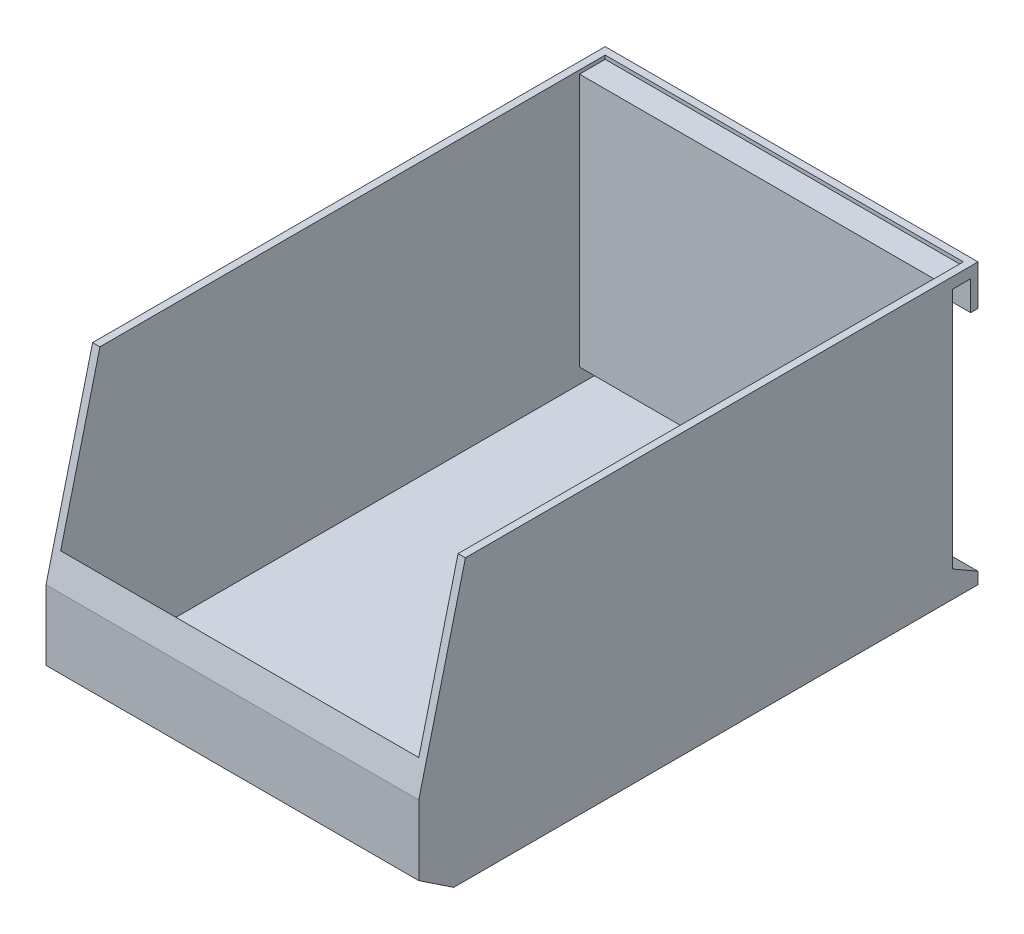
ISO-10303-21;
HEADER;
FILE_DESCRIPTION(('STEP AP214'),'2;1');
FILE_NAME('part.step','',(''),(''),'','','');
FILE_SCHEMA(('AUTOMOTIVE_DESIGN { 1 0 10303 214 1 1 1 1 }'));
ENDSEC;
DATA;
#1=APPLICATION_CONTEXT('core data for automotive mechanical design processes');
#2=APPLICATION_PROTOCOL_DEFINITION('international standard','automotive_design',2000,#1);
#3=PRODUCT_CONTEXT('',#1,'mechanical');
#4=PRODUCT('Part','Part','',(#3));
#5=PRODUCT_RELATED_PRODUCT_CATEGORY('part','',(#4));
#6=PRODUCT_DEFINITION_FORMATION('','',#4);
#7=PRODUCT_DEFINITION_CONTEXT('part definition',#1,'design');
#8=PRODUCT_DEFINITION('design','',#6,#7);
#9=PRODUCT_DEFINITION_SHAPE('','',#8);
#10=(LENGTH_UNIT() NAMED_UNIT(*) SI_UNIT(.MILLI.,.METRE.));
#11=(NAMED_UNIT(*) PLANE_ANGLE_UNIT() SI_UNIT($,.RADIAN.));
#12=(NAMED_UNIT(*) SI_UNIT($,.STERADIAN.) SOLID_ANGLE_UNIT());
#13=UNCERTAINTY_MEASURE_WITH_UNIT(LENGTH_MEASURE(1.E-05),#10,'distance_accuracy_value','');
#14=(GEOMETRIC_REPRESENTATION_CONTEXT(3) GLOBAL_UNCERTAINTY_ASSIGNED_CONTEXT((#13)) GLOBAL_UNIT_ASSIGNED_CONTEXT((#10,
#11,#12)) REPRESENTATION_CONTEXT('',''));
#15=CARTESIAN_POINT('',(0.,0.,0.));
#16=DIRECTION('',(0.,0.,1.));
#17=DIRECTION('',(1.,0.,0.));
#18=AXIS2_PLACEMENT_3D('',#15,#16,#17);
#19=CARTESIAN_POINT('',(0.,76.2,0.));
#20=DIRECTION('',(0.,-1.,0.));
#21=DIRECTION('',(0.,0.,-1.));
#22=AXIS2_PLACEMENT_3D('',#19,#20,#21);
#23=PLANE('',#22);
#24=DIRECTION('',(0.,0.,1.));
#25=VECTOR('',#24,1.);
#26=CARTESIAN_POINT('',(-48.8,76.2,0.));
#27=LINE('',#26,#25);
#28=CARTESIAN_POINT('',(-48.8,76.2,-74.2));
#29=VERTEX_POINT('',#28);
#30=CARTESIAN_POINT('',(-48.8,76.2,63.5));
#31=VERTEX_POINT('',#30);
#32=EDGE_CURVE('E206',#29,#31,#27,.T.);
#33=ORIENTED_EDGE('',*,*,#32,.F.);
#34=DIRECTION('',(-1.,0.,0.));
#35=VECTOR('',#34,1.);
#36=CARTESIAN_POINT('',(0.,76.2,-74.2));
#37=LINE('',#36,#35);
#38=CARTESIAN_POINT('',(48.8,76.2,-74.2));
#39=VERTEX_POINT('',#38);
#40=EDGE_CURVE('E210',#39,#29,#37,.T.);
#41=ORIENTED_EDGE('',*,*,#40,.F.);
#42=DIRECTION('',(0.,0.,-1.));
#43=VECTOR('',#42,1.);
#44=CARTESIAN_POINT('',(48.8,76.2,0.));
#45=LINE('',#44,#43);
#46=CARTESIAN_POINT('',(48.8,76.2,63.5));
#47=VERTEX_POINT('',#46);
#48=EDGE_CURVE('E246',#47,#39,#45,.T.);
#49=ORIENTED_EDGE('',*,*,#48,.F.);
#50=DIRECTION('',(1.,0.,0.));
#51=VECTOR('',#50,1.);
#52=CARTESIAN_POINT('',(-50.8,76.2,63.5));
#53=LINE('',#52,#51);
#54=CARTESIAN_POINT('',(50.8,76.2,63.5));
#55=VERTEX_POINT('',#54);
#56=EDGE_CURVE('E315',#47,#55,#53,.T.);
#57=ORIENTED_EDGE('',*,*,#56,.T.);
#58=DIRECTION('',(0.,0.,-1.));
#59=VECTOR('',#58,1.);
#60=CARTESIAN_POINT('',(50.8,76.2,76.2));
#61=LINE('',#60,#59);
#62=CARTESIAN_POINT('',(50.8,76.2,-76.2));
#63=VERTEX_POINT('',#62);
#64=EDGE_CURVE('E325',#55,#63,#61,.T.);
#65=ORIENTED_EDGE('',*,*,#64,.T.);
#66=DIRECTION('',(-1.,0.,0.));
#67=VECTOR('',#66,1.);
#68=CARTESIAN_POINT('',(-50.8,76.2,-76.2));
#69=LINE('',#68,#67);
#70=CARTESIAN_POINT('',(-50.8,76.2,-76.2));
#71=VERTEX_POINT('',#70);
#72=EDGE_CURVE('E327',#63,#71,#69,.T.);
#73=ORIENTED_EDGE('',*,*,#72,.T.);
#74=DIRECTION('',(0.,0.,1.));
#75=VECTOR('',#74,1.);
#76=CARTESIAN_POINT('',(-50.8,76.2,76.2));
#77=LINE('',#76,#75);
#78=CARTESIAN_POINT('',(-50.8,76.2,63.5));
#79=VERTEX_POINT('',#78);
#80=EDGE_CURVE('E330',#71,#79,#77,.T.);
#81=ORIENTED_EDGE('',*,*,#80,.T.);
#82=EDGE_CURVE('E311',#79,#31,#53,.T.);
#83=ORIENTED_EDGE('',*,*,#82,.T.);
#84=EDGE_LOOP('',(#33,#41,#49,#57,#65,#73,#81,#83));
#85=FACE_BOUND('',#84,.T.);
#86=ADVANCED_FACE('F34',(#85),#23,.F.);
#87=CARTESIAN_POINT('',(-50.8,76.2,63.5));
#88=DIRECTION('',(0.,-0.242535625036333,-0.970142500145332));
#89=DIRECTION('',(0.,0.970142500145332,-0.242535625036333));
#90=AXIS2_PLACEMENT_3D('',#87,#88,#89);
#91=PLANE('',#90);
#92=DIRECTION('',(0.,0.970142500145332,-0.242535625036333));
#93=VECTOR('',#92,1.);
#94=CARTESIAN_POINT('',(48.8,76.2,63.5));
#95=LINE('',#94,#93);
#96=CARTESIAN_POINT('',(48.8,33.4,74.2));
#97=VERTEX_POINT('',#96);
#98=EDGE_CURVE('E249',#97,#47,#95,.T.);
#99=ORIENTED_EDGE('',*,*,#98,.F.);
#100=DIRECTION('',(1.,0.,0.));
#101=VECTOR('',#100,1.);
#102=CARTESIAN_POINT('',(-50.8,33.4,74.2));
#103=LINE('',#102,#101);
#104=CARTESIAN_POINT('',(-48.8,33.4,74.2));
#105=VERTEX_POINT('',#104);
#106=EDGE_CURVE('E205',#105,#97,#103,.T.);
#107=ORIENTED_EDGE('',*,*,#106,.F.);
#108=DIRECTION('',(0.,0.970142500145332,-0.242535625036333));
#109=VECTOR('',#108,1.);
#110=CARTESIAN_POINT('',(-48.8,73.2117647058823,64.2470588235294));
#111=LINE('',#110,#109);
#112=EDGE_CURVE('E253',#105,#31,#111,.T.);
#113=ORIENTED_EDGE('',*,*,#112,.T.);
#114=ORIENTED_EDGE('',*,*,#82,.F.);
#115=DIRECTION('',(0.,0.970142500145332,-0.242535625036333));
#116=VECTOR('',#115,1.);
#117=CARTESIAN_POINT('',(-50.8,76.2,63.5));
#118=LINE('',#117,#116);
#119=CARTESIAN_POINT('',(-50.8,25.4,76.2));
#120=VERTEX_POINT('',#119);
#121=EDGE_CURVE('E303',#120,#79,#118,.T.);
#122=ORIENTED_EDGE('',*,*,#121,.F.);
#123=DIRECTION('',(1.,0.,0.));
#124=VECTOR('',#123,1.);
#125=CARTESIAN_POINT('',(-50.8,25.4,76.2));
#126=LINE('',#125,#124);
#127=CARTESIAN_POINT('',(50.8,25.4,76.2));
#128=VERTEX_POINT('',#127);
#129=EDGE_CURVE('E306',#120,#128,#126,.T.);
#130=ORIENTED_EDGE('',*,*,#129,.T.);
#131=DIRECTION('',(0.,0.970142500145332,-0.242535625036333));
#132=VECTOR('',#131,1.);
#133=CARTESIAN_POINT('',(50.8,76.2,63.5));
#134=LINE('',#133,#132);
#135=EDGE_CURVE('E307',#128,#55,#134,.T.);
#136=ORIENTED_EDGE('',*,*,#135,.T.);
#137=ORIENTED_EDGE('',*,*,#56,.F.);
#138=EDGE_LOOP('',(#99,#107,#113,#114,#122,#130,#136,#137));
#139=FACE_BOUND('',#138,.T.);
#140=ADVANCED_FACE('F408',(#139),#91,.F.);
#141=CARTESIAN_POINT('',(-50.8,76.2,-76.2));
#142=DIRECTION('',(0.,0.,1.));
#143=DIRECTION('',(1.,0.,0.));
#144=AXIS2_PLACEMENT_3D('',#141,#142,#143);
#145=PLANE('',#144);
#146=DIRECTION('',(0.,-1.,0.));
#147=VECTOR('',#146,1.);
#148=CARTESIAN_POINT('',(50.8,76.2,-76.2));
#149=LINE('',#148,#147);
#150=CARTESIAN_POINT('',(50.8,65.2,-76.2));
#151=VERTEX_POINT('',#150);
#152=EDGE_CURVE('E11',#63,#151,#149,.T.);
#153=ORIENTED_EDGE('',*,*,#152,.T.);
#154=DIRECTION('',(1.,0.,0.));
#155=VECTOR('',#154,1.);
#156=CARTESIAN_POINT('',(-50.8,65.2,-76.2));
#157=LINE('',#156,#155);
#158=CARTESIAN_POINT('',(-50.8,65.2,-76.2));
#159=VERTEX_POINT('',#158);
#160=EDGE_CURVE('E297',#159,#151,#157,.T.);
#161=ORIENTED_EDGE('',*,*,#160,.F.);
#162=DIRECTION('',(0.,-1.,0.));
#163=VECTOR('',#162,1.);
#164=CARTESIAN_POINT('',(-50.8,76.2,-76.2));
#165=LINE('',#164,#163);
#166=EDGE_CURVE('E346',#71,#159,#165,.T.);
#167=ORIENTED_EDGE('',*,*,#166,.F.);
#168=ORIENTED_EDGE('',*,*,#72,.F.);
#169=EDGE_LOOP('',(#153,#161,#167,#168));
#170=FACE_BOUND('',#169,.T.);
#171=ADVANCED_FACE('F381',(#170),#145,.F.);
#172=CARTESIAN_POINT('',(50.8,76.2,76.2));
#173=DIRECTION('',(-1.,0.,0.));
#174=DIRECTION('',(0.,0.,1.));
#175=AXIS2_PLACEMENT_3D('',#172,#173,#174);
#176=PLANE('',#175);
#177=DIRECTION('',(0.,1.,0.));
#178=VECTOR('',#177,1.);
#179=CARTESIAN_POINT('',(50.8,73.2,-74.2));
#180=LINE('',#179,#178);
#181=CARTESIAN_POINT('',(50.8,65.2,-74.2));
#182=VERTEX_POINT('',#181);
#183=CARTESIAN_POINT('',(50.8,73.2,-74.2));
#184=VERTEX_POINT('',#183);
#185=EDGE_CURVE('E285',#182,#184,#180,.T.);
#186=ORIENTED_EDGE('',*,*,#185,.F.);
#187=DIRECTION('',(0.,0.,1.));
#188=VECTOR('',#187,1.);
#189=CARTESIAN_POINT('',(50.8,65.2,-74.2));
#190=LINE('',#189,#188);
#191=EDGE_CURVE('E282',#151,#182,#190,.T.);
#192=ORIENTED_EDGE('',*,*,#191,.F.);
#193=ORIENTED_EDGE('',*,*,#152,.F.);
#194=ORIENTED_EDGE('',*,*,#64,.F.);
#195=ORIENTED_EDGE('',*,*,#135,.F.);
#196=DIRECTION('',(0.,-1.,0.));
#197=VECTOR('',#196,1.);
#198=CARTESIAN_POINT('',(50.8,76.2,76.2));
#199=LINE('',#198,#197);
#200=CARTESIAN_POINT('',(50.8,6.35,76.2));
#201=VERTEX_POINT('',#200);
#202=EDGE_CURVE('E333',#128,#201,#199,.T.);
#203=ORIENTED_EDGE('',*,*,#202,.T.);
#204=DIRECTION('',(0.,0.554700196225229,0.832050294337844));
#205=VECTOR('',#204,1.);
#206=CARTESIAN_POINT('',(50.8,6.35,76.2));
#207=LINE('',#206,#205);
#208=CARTESIAN_POINT('',(50.8,0.,66.675));
#209=VERTEX_POINT('',#208);
#210=EDGE_CURVE('E292',#209,#201,#207,.T.);
#211=ORIENTED_EDGE('',*,*,#210,.F.);
#212=DIRECTION('',(0.,0.,-1.));
#213=VECTOR('',#212,1.);
#214=CARTESIAN_POINT('',(50.8,0.,76.2));
#215=LINE('',#214,#213);
#216=CARTESIAN_POINT('',(50.8,0.,-76.2));
#217=VERTEX_POINT('',#216);
#218=EDGE_CURVE('E314',#209,#217,#215,.T.);
#219=ORIENTED_EDGE('',*,*,#218,.T.);
#220=CARTESIAN_POINT('',(50.8,3.175,-76.2));
#221=VERTEX_POINT('',#220);
#222=EDGE_CURVE('E42',#221,#217,#149,.T.);
#223=ORIENTED_EDGE('',*,*,#222,.F.);
#224=DIRECTION('',(0.,-0.499999999999995,-0.866025403784442));
#225=VECTOR('',#224,1.);
#226=CARTESIAN_POINT('',(50.8,7.21645188432733,-69.2));
#227=LINE('',#226,#225);
#228=CARTESIAN_POINT('',(50.8,7.21645188432733,-69.2));
#229=VERTEX_POINT('',#228);
#230=EDGE_CURVE('E280',#229,#221,#227,.T.);
#231=ORIENTED_EDGE('',*,*,#230,.F.);
#232=DIRECTION('',(0.,-1.,0.));
#233=VECTOR('',#232,1.);
#234=CARTESIAN_POINT('',(50.8,7.21645188432733,-69.2));
#235=LINE('',#234,#233);
#236=CARTESIAN_POINT('',(50.8,73.2,-69.2));
#237=VERTEX_POINT('',#236);
#238=EDGE_CURVE('E262',#237,#229,#235,.T.);
#239=ORIENTED_EDGE('',*,*,#238,.F.);
#240=DIRECTION('',(0.,0.,1.));
#241=VECTOR('',#240,1.);
#242=CARTESIAN_POINT('',(50.8,73.2,-69.2));
#243=LINE('',#242,#241);
#244=EDGE_CURVE('E266',#184,#237,#243,.T.);
#245=ORIENTED_EDGE('',*,*,#244,.F.);
#246=EDGE_LOOP('',(#186,#192,#193,#194,#195,#203,#211,#219,#223,#231,#239,#245));
#247=FACE_BOUND('',#246,.T.);
#248=ADVANCED_FACE('F36',(#247),#176,.F.);
#249=CARTESIAN_POINT('',(-50.8,3.175,-76.2));
#250=VERTEX_POINT('',#249);
#251=CARTESIAN_POINT('',(-50.8,0.,-76.2));
#252=VERTEX_POINT('',#251);
#253=EDGE_CURVE('E345',#250,#252,#165,.T.);
#254=ORIENTED_EDGE('',*,*,#253,.F.);
#255=DIRECTION('',(1.,0.,0.));
#256=VECTOR('',#255,1.);
#257=CARTESIAN_POINT('',(-50.8,3.175,-76.2));
#258=LINE('',#257,#256);
#259=EDGE_CURVE('E299',#250,#221,#258,.T.);
#260=ORIENTED_EDGE('',*,*,#259,.T.);
#261=ORIENTED_EDGE('',*,*,#222,.T.);
#262=DIRECTION('',(-1.,0.,0.));
#263=VECTOR('',#262,1.);
#264=CARTESIAN_POINT('',(-50.8,0.,-76.2));
#265=LINE('',#264,#263);
#266=EDGE_CURVE('E336',#217,#252,#265,.T.);
#267=ORIENTED_EDGE('',*,*,#266,.T.);
#268=EDGE_LOOP('',(#254,#260,#261,#267));
#269=FACE_BOUND('',#268,.T.);
#270=ADVANCED_FACE('F356',(#269),#145,.F.);
#271=CARTESIAN_POINT('',(-50.8,76.2,76.2));
#272=DIRECTION('',(1.,0.,0.));
#273=DIRECTION('',(0.,0.,-1.));
#274=AXIS2_PLACEMENT_3D('',#271,#272,#273);
#275=PLANE('',#274);
#276=ORIENTED_EDGE('',*,*,#166,.T.);
#277=DIRECTION('',(0.,0.,1.));
#278=VECTOR('',#277,1.);
#279=CARTESIAN_POINT('',(-50.8,65.2,-74.2));
#280=LINE('',#279,#278);
#281=CARTESIAN_POINT('',(-50.8,65.2,-74.2));
#282=VERTEX_POINT('',#281);
#283=EDGE_CURVE('E268',#159,#282,#280,.T.);
#284=ORIENTED_EDGE('',*,*,#283,.T.);
#285=DIRECTION('',(0.,1.,0.));
#286=VECTOR('',#285,1.);
#287=CARTESIAN_POINT('',(-50.8,73.2,-74.2));
#288=LINE('',#287,#286);
#289=CARTESIAN_POINT('',(-50.8,73.2,-74.2));
#290=VERTEX_POINT('',#289);
#291=EDGE_CURVE('E271',#282,#290,#288,.T.);
#292=ORIENTED_EDGE('',*,*,#291,.T.);
#293=DIRECTION('',(0.,0.,1.));
#294=VECTOR('',#293,1.);
#295=CARTESIAN_POINT('',(-50.8,73.2,-69.2));
#296=LINE('',#295,#294);
#297=CARTESIAN_POINT('',(-50.8,73.2,-69.2));
#298=VERTEX_POINT('',#297);
#299=EDGE_CURVE('E274',#290,#298,#296,.T.);
#300=ORIENTED_EDGE('',*,*,#299,.T.);
#301=DIRECTION('',(0.,-1.,0.));
#302=VECTOR('',#301,1.);
#303=CARTESIAN_POINT('',(-50.8,65.2,-69.2));
#304=LINE('',#303,#302);
#305=CARTESIAN_POINT('',(-50.8,7.21645188432733,-69.2));
#306=VERTEX_POINT('',#305);
#307=EDGE_CURVE('E263',#298,#306,#304,.T.);
#308=ORIENTED_EDGE('',*,*,#307,.T.);
#309=DIRECTION('',(0.,-0.499999999999995,-0.866025403784442));
#310=VECTOR('',#309,1.);
#311=CARTESIAN_POINT('',(-50.8,7.21645188432733,-69.2));
#312=LINE('',#311,#310);
#313=EDGE_CURVE('E57',#306,#250,#312,.T.);
#314=ORIENTED_EDGE('',*,*,#313,.T.);
#315=ORIENTED_EDGE('',*,*,#253,.T.);
#316=DIRECTION('',(0.,0.,1.));
#317=VECTOR('',#316,1.);
#318=CARTESIAN_POINT('',(-50.8,0.,76.2));
#319=LINE('',#318,#317);
#320=CARTESIAN_POINT('',(-50.8,0.,66.675));
#321=VERTEX_POINT('',#320);
#322=EDGE_CURVE('E328',#252,#321,#319,.T.);
#323=ORIENTED_EDGE('',*,*,#322,.T.);
#324=DIRECTION('',(0.,0.554700196225229,0.832050294337844));
#325=VECTOR('',#324,1.);
#326=CARTESIAN_POINT('',(-50.8,6.35,76.2));
#327=LINE('',#326,#325);
#328=CARTESIAN_POINT('',(-50.8,6.35,76.2));
#329=VERTEX_POINT('',#328);
#330=EDGE_CURVE('E317',#321,#329,#327,.T.);
#331=ORIENTED_EDGE('',*,*,#330,.T.);
#332=DIRECTION('',(0.,-1.,0.));
#333=VECTOR('',#332,1.);
#334=CARTESIAN_POINT('',(-50.8,76.2,76.2));
#335=LINE('',#334,#333);
#336=EDGE_CURVE('E343',#120,#329,#335,.T.);
#337=ORIENTED_EDGE('',*,*,#336,.F.);
#338=ORIENTED_EDGE('',*,*,#121,.T.);
#339=ORIENTED_EDGE('',*,*,#80,.F.);
#340=EDGE_LOOP('',(#276,#284,#292,#300,#308,#314,#315,#323,#331,#337,#338,#339));
#341=FACE_BOUND('',#340,.T.);
#342=ADVANCED_FACE('F352',(#341),#275,.F.);
#343=CARTESIAN_POINT('',(-50.8,76.2,76.2));
#344=DIRECTION('',(0.,0.,-1.));
#345=DIRECTION('',(-1.,0.,0.));
#346=AXIS2_PLACEMENT_3D('',#343,#344,#345);
#347=PLANE('',#346);
#348=ORIENTED_EDGE('',*,*,#202,.F.);
#349=ORIENTED_EDGE('',*,*,#129,.F.);
#350=ORIENTED_EDGE('',*,*,#336,.T.);
#351=DIRECTION('',(1.,0.,0.));
#352=VECTOR('',#351,1.);
#353=CARTESIAN_POINT('',(-50.8,6.35,76.2));
#354=LINE('',#353,#352);
#355=EDGE_CURVE('E320',#329,#201,#354,.T.);
#356=ORIENTED_EDGE('',*,*,#355,.T.);
#357=EDGE_LOOP('',(#348,#349,#350,#356));
#358=FACE_BOUND('',#357,.T.);
#359=ADVANCED_FACE('F372',(#358),#347,.F.);
#360=CARTESIAN_POINT('',(0.,0.,0.));
#361=DIRECTION('',(0.,-1.,0.));
#362=DIRECTION('',(0.,0.,-1.));
#363=AXIS2_PLACEMENT_3D('',#360,#361,#362);
#364=PLANE('',#363);
#365=DIRECTION('',(1.,0.,0.));
#366=VECTOR('',#365,1.);
#367=CARTESIAN_POINT('',(-50.8,0.,66.675));
#368=LINE('',#367,#366);
#369=EDGE_CURVE('E310',#321,#209,#368,.T.);
#370=ORIENTED_EDGE('',*,*,#369,.F.);
#371=ORIENTED_EDGE('',*,*,#322,.F.);
#372=ORIENTED_EDGE('',*,*,#266,.F.);
#373=ORIENTED_EDGE('',*,*,#218,.F.);
#374=EDGE_LOOP('',(#370,#371,#372,#373));
#375=FACE_BOUND('',#374,.T.);
#376=ADVANCED_FACE('F361',(#375),#364,.T.);
#377=CARTESIAN_POINT('',(-50.8,6.35,76.2));
#378=DIRECTION('',(0.,0.832050294337844,-0.554700196225229));
#379=DIRECTION('',(0.,0.554700196225229,0.832050294337844));
#380=AXIS2_PLACEMENT_3D('',#377,#378,#379);
#381=PLANE('',#380);
#382=ORIENTED_EDGE('',*,*,#210,.T.);
#383=ORIENTED_EDGE('',*,*,#355,.F.);
#384=ORIENTED_EDGE('',*,*,#330,.F.);
#385=ORIENTED_EDGE('',*,*,#369,.T.);
#386=EDGE_LOOP('',(#382,#383,#384,#385));
#387=FACE_BOUND('',#386,.T.);
#388=ADVANCED_FACE('F364',(#387),#381,.F.);
#389=CARTESIAN_POINT('',(-50.8,73.2,-69.2));
#390=DIRECTION('',(0.,1.,0.));
#391=DIRECTION('',(0.,0.,1.));
#392=AXIS2_PLACEMENT_3D('',#389,#390,#391);
#393=PLANE('',#392);
#394=ORIENTED_EDGE('',*,*,#244,.T.);
#395=DIRECTION('',(1.,0.,0.));
#396=VECTOR('',#395,1.);
#397=CARTESIAN_POINT('',(-50.8,73.2,-69.2));
#398=LINE('',#397,#396);
#399=EDGE_CURVE('E290',#298,#237,#398,.T.);
#400=ORIENTED_EDGE('',*,*,#399,.F.);
#401=ORIENTED_EDGE('',*,*,#299,.F.);
#402=DIRECTION('',(1.,0.,0.));
#403=VECTOR('',#402,1.);
#404=CARTESIAN_POINT('',(-50.8,73.2,-74.2));
#405=LINE('',#404,#403);
#406=EDGE_CURVE('E293',#290,#184,#405,.T.);
#407=ORIENTED_EDGE('',*,*,#406,.T.);
#408=EDGE_LOOP('',(#394,#400,#401,#407));
#409=FACE_BOUND('',#408,.T.);
#410=ADVANCED_FACE('F393',(#409),#393,.F.);
#411=CARTESIAN_POINT('',(-50.8,73.2,-74.2));
#412=DIRECTION('',(0.,0.,-1.));
#413=DIRECTION('',(-1.,0.,0.));
#414=AXIS2_PLACEMENT_3D('',#411,#412,#413);
#415=PLANE('',#414);
#416=ORIENTED_EDGE('',*,*,#185,.T.);
#417=ORIENTED_EDGE('',*,*,#406,.F.);
#418=ORIENTED_EDGE('',*,*,#291,.F.);
#419=DIRECTION('',(1.,0.,0.));
#420=VECTOR('',#419,1.);
#421=CARTESIAN_POINT('',(-50.8,65.2,-74.2));
#422=LINE('',#421,#420);
#423=EDGE_CURVE('E295',#282,#182,#422,.T.);
#424=ORIENTED_EDGE('',*,*,#423,.T.);
#425=EDGE_LOOP('',(#416,#417,#418,#424));
#426=FACE_BOUND('',#425,.T.);
#427=ADVANCED_FACE('F388',(#426),#415,.F.);
#428=CARTESIAN_POINT('',(-50.8,65.2,-74.2));
#429=DIRECTION('',(0.,1.,0.));
#430=DIRECTION('',(0.,0.,1.));
#431=AXIS2_PLACEMENT_3D('',#428,#429,#430);
#432=PLANE('',#431);
#433=ORIENTED_EDGE('',*,*,#191,.T.);
#434=ORIENTED_EDGE('',*,*,#423,.F.);
#435=ORIENTED_EDGE('',*,*,#283,.F.);
#436=ORIENTED_EDGE('',*,*,#160,.T.);
#437=EDGE_LOOP('',(#433,#434,#435,#436));
#438=FACE_BOUND('',#437,.T.);
#439=ADVANCED_FACE('F384',(#438),#432,.F.);
#440=CARTESIAN_POINT('',(-50.8,7.21645188432733,-69.2));
#441=DIRECTION('',(0.,-0.866025403784442,0.499999999999995));
#442=DIRECTION('',(0.,-0.499999999999995,-0.866025403784442));
#443=AXIS2_PLACEMENT_3D('',#440,#441,#442);
#444=PLANE('',#443);
#445=ORIENTED_EDGE('',*,*,#230,.T.);
#446=ORIENTED_EDGE('',*,*,#259,.F.);
#447=ORIENTED_EDGE('',*,*,#313,.F.);
#448=DIRECTION('',(1.,0.,0.));
#449=VECTOR('',#448,1.);
#450=CARTESIAN_POINT('',(-50.8,7.21645188432733,-69.2));
#451=LINE('',#450,#449);
#452=EDGE_CURVE('E277',#306,#229,#451,.T.);
#453=ORIENTED_EDGE('',*,*,#452,.T.);
#454=EDGE_LOOP('',(#445,#446,#447,#453));
#455=FACE_BOUND('',#454,.T.);
#456=ADVANCED_FACE('F397',(#455),#444,.F.);
#457=CARTESIAN_POINT('',(-50.8,7.21645188432733,-69.2));
#458=DIRECTION('',(0.,0.,1.));
#459=DIRECTION('',(1.,0.,0.));
#460=AXIS2_PLACEMENT_3D('',#457,#458,#459);
#461=PLANE('',#460);
#462=ORIENTED_EDGE('',*,*,#238,.T.);
#463=ORIENTED_EDGE('',*,*,#452,.F.);
#464=ORIENTED_EDGE('',*,*,#307,.F.);
#465=ORIENTED_EDGE('',*,*,#399,.T.);
#466=EDGE_LOOP('',(#462,#463,#464,#465));
#467=FACE_BOUND('',#466,.T.);
#468=ADVANCED_FACE('F395',(#467),#461,.F.);
#469=CARTESIAN_POINT('',(-50.8,76.2,-74.2));
#470=DIRECTION('',(0.,0.,1.));
#471=DIRECTION('',(1.,0.,0.));
#472=AXIS2_PLACEMENT_3D('',#469,#470,#471);
#473=PLANE('',#472);
#474=DIRECTION('',(1.,0.,0.));
#475=VECTOR('',#474,1.);
#476=CARTESIAN_POINT('',(-50.8,75.2,-74.2));
#477=LINE('',#476,#475);
#478=CARTESIAN_POINT('',(-48.8,75.2,-74.2));
#479=VERTEX_POINT('',#478);
#480=CARTESIAN_POINT('',(48.8,75.2,-74.2));
#481=VERTEX_POINT('',#480);
#482=EDGE_CURVE('E260',#479,#481,#477,.T.);
#483=ORIENTED_EDGE('',*,*,#482,.T.);
#484=DIRECTION('',(0.,-1.,0.));
#485=VECTOR('',#484,1.);
#486=CARTESIAN_POINT('',(48.8,76.2,-74.2));
#487=LINE('',#486,#485);
#488=EDGE_CURVE('E220',#39,#481,#487,.T.);
#489=ORIENTED_EDGE('',*,*,#488,.F.);
#490=ORIENTED_EDGE('',*,*,#40,.T.);
#491=DIRECTION('',(0.,-1.,0.));
#492=VECTOR('',#491,1.);
#493=CARTESIAN_POINT('',(-48.8,76.2,-74.2));
#494=LINE('',#493,#492);
#495=EDGE_CURVE('E213',#29,#479,#494,.T.);
#496=ORIENTED_EDGE('',*,*,#495,.T.);
#497=EDGE_LOOP('',(#483,#489,#490,#496));
#498=FACE_BOUND('',#497,.T.);
#499=ADVANCED_FACE('F404',(#498),#473,.T.);
#500=CARTESIAN_POINT('',(48.8,76.2,76.2));
#501=DIRECTION('',(-1.,0.,0.));
#502=DIRECTION('',(0.,0.,1.));
#503=AXIS2_PLACEMENT_3D('',#500,#501,#502);
#504=PLANE('',#503);
#505=DIRECTION('',(0.,0.,1.));
#506=VECTOR('',#505,1.);
#507=CARTESIAN_POINT('',(48.8,75.2,-69.2));
#508=LINE('',#507,#506);
#509=CARTESIAN_POINT('',(48.8,75.2,-67.2));
#510=VERTEX_POINT('',#509);
#511=EDGE_CURVE('E223',#481,#510,#508,.T.);
#512=ORIENTED_EDGE('',*,*,#511,.T.);
#513=DIRECTION('',(0.,-1.,0.));
#514=VECTOR('',#513,1.);
#515=CARTESIAN_POINT('',(48.8,7.21645188432733,-67.2));
#516=LINE('',#515,#514);
#517=CARTESIAN_POINT('',(48.8,6.06175134594807,-67.2));
#518=VERTEX_POINT('',#517);
#519=EDGE_CURVE('E224',#510,#518,#516,.T.);
#520=ORIENTED_EDGE('',*,*,#519,.T.);
#521=DIRECTION('',(0.,-0.499999999999995,-0.866025403784442));
#522=VECTOR('',#521,1.);
#523=CARTESIAN_POINT('',(48.8,5.48440107675844,-68.2));
#524=LINE('',#523,#522);
#525=CARTESIAN_POINT('',(48.8,2.02029946162074,-74.2));
#526=VERTEX_POINT('',#525);
#527=EDGE_CURVE('E221',#518,#526,#524,.T.);
#528=ORIENTED_EDGE('',*,*,#527,.T.);
#529=DIRECTION('',(0.,-1.,0.));
#530=VECTOR('',#529,1.);
#531=CARTESIAN_POINT('',(48.8,76.2,-74.2));
#532=LINE('',#531,#530);
#533=CARTESIAN_POINT('',(48.8,2.,-74.2));
#534=VERTEX_POINT('',#533);
#535=EDGE_CURVE('E218',#526,#534,#532,.T.);
#536=ORIENTED_EDGE('',*,*,#535,.T.);
#537=DIRECTION('',(0.,0.,-1.));
#538=VECTOR('',#537,1.);
#539=CARTESIAN_POINT('',(48.8,2.,0.));
#540=LINE('',#539,#538);
#541=CARTESIAN_POINT('',(48.8,2.,66.069448724536));
#542=VERTEX_POINT('',#541);
#543=EDGE_CURVE('E192',#542,#534,#540,.T.);
#544=ORIENTED_EDGE('',*,*,#543,.F.);
#545=DIRECTION('',(0.,0.554700196225229,0.832050294337844));
#546=VECTOR('',#545,1.);
#547=CARTESIAN_POINT('',(48.8,8.01410058867569,75.0905996075495));
#548=LINE('',#547,#546);
#549=CARTESIAN_POINT('',(48.8,7.42036751697599,74.2));
#550=VERTEX_POINT('',#549);
#551=EDGE_CURVE('E184',#542,#550,#548,.T.);
#552=ORIENTED_EDGE('',*,*,#551,.T.);
#553=DIRECTION('',(0.,-1.,0.));
#554=VECTOR('',#553,1.);
#555=CARTESIAN_POINT('',(48.8,76.2,74.2));
#556=LINE('',#555,#554);
#557=EDGE_CURVE('E189',#97,#550,#556,.T.);
#558=ORIENTED_EDGE('',*,*,#557,.F.);
#559=ORIENTED_EDGE('',*,*,#98,.T.);
#560=ORIENTED_EDGE('',*,*,#48,.T.);
#561=ORIENTED_EDGE('',*,*,#488,.T.);
#562=EDGE_LOOP('',(#512,#520,#528,#536,#544,#552,#558,#559,#560,#561));
#563=FACE_BOUND('',#562,.T.);
#564=ADVANCED_FACE('F187',(#563),#504,.T.);
#565=DIRECTION('',(0.,-1.,0.));
#566=VECTOR('',#565,1.);
#567=CARTESIAN_POINT('',(-48.8,76.2,-74.2));
#568=LINE('',#567,#566);
#569=CARTESIAN_POINT('',(-48.8,2.02029946162074,-74.2));
#570=VERTEX_POINT('',#569);
#571=CARTESIAN_POINT('',(-48.8,2.,-74.2));
#572=VERTEX_POINT('',#571);
#573=EDGE_CURVE('E208',#570,#572,#568,.T.);
#574=ORIENTED_EDGE('',*,*,#573,.T.);
#575=DIRECTION('',(-1.,0.,0.));
#576=VECTOR('',#575,1.);
#577=CARTESIAN_POINT('',(0.,2.,-74.2));
#578=LINE('',#577,#576);
#579=EDGE_CURVE('E217',#534,#572,#578,.T.);
#580=ORIENTED_EDGE('',*,*,#579,.F.);
#581=ORIENTED_EDGE('',*,*,#535,.F.);
#582=DIRECTION('',(1.,0.,0.));
#583=VECTOR('',#582,1.);
#584=CARTESIAN_POINT('',(-50.8,2.02029946162074,-74.2));
#585=LINE('',#584,#583);
#586=EDGE_CURVE('E230',#570,#526,#585,.T.);
#587=ORIENTED_EDGE('',*,*,#586,.F.);
#588=EDGE_LOOP('',(#574,#580,#581,#587));
#589=FACE_BOUND('',#588,.T.);
#590=ADVANCED_FACE('F499',(#589),#473,.T.);
#591=CARTESIAN_POINT('',(-48.8,76.2,76.2));
#592=DIRECTION('',(1.,0.,0.));
#593=DIRECTION('',(0.,0.,-1.));
#594=AXIS2_PLACEMENT_3D('',#591,#592,#593);
#595=PLANE('',#594);
#596=ORIENTED_EDGE('',*,*,#495,.F.);
#597=ORIENTED_EDGE('',*,*,#32,.T.);
#598=ORIENTED_EDGE('',*,*,#112,.F.);
#599=DIRECTION('',(0.,-1.,0.));
#600=VECTOR('',#599,1.);
#601=CARTESIAN_POINT('',(-48.8,76.2,74.2));
#602=LINE('',#601,#600);
#603=CARTESIAN_POINT('',(-48.8,7.42036751697599,74.2));
#604=VERTEX_POINT('',#603);
#605=EDGE_CURVE('E49',#105,#604,#602,.T.);
#606=ORIENTED_EDGE('',*,*,#605,.T.);
#607=DIRECTION('',(0.,0.554700196225229,0.832050294337844));
#608=VECTOR('',#607,1.);
#609=CARTESIAN_POINT('',(-48.8,29.5064082809834,107.329061146011));
#610=LINE('',#609,#608);
#611=CARTESIAN_POINT('',(-48.8,2.,66.069448724536));
#612=VERTEX_POINT('',#611);
#613=EDGE_CURVE('E195',#612,#604,#610,.T.);
#614=ORIENTED_EDGE('',*,*,#613,.F.);
#615=DIRECTION('',(0.,0.,1.));
#616=VECTOR('',#615,1.);
#617=CARTESIAN_POINT('',(-48.8,2.,0.));
#618=LINE('',#617,#616);
#619=EDGE_CURVE('E236',#572,#612,#618,.T.);
#620=ORIENTED_EDGE('',*,*,#619,.F.);
#621=ORIENTED_EDGE('',*,*,#573,.F.);
#622=DIRECTION('',(0.,-0.499999999999995,-0.866025403784442));
#623=VECTOR('',#622,1.);
#624=CARTESIAN_POINT('',(-48.8,85.6903349608045,70.7207525556799));
#625=LINE('',#624,#623);
#626=CARTESIAN_POINT('',(-48.8,6.06175134594807,-67.2));
#627=VERTEX_POINT('',#626);
#628=EDGE_CURVE('E239',#627,#570,#625,.T.);
#629=ORIENTED_EDGE('',*,*,#628,.F.);
#630=DIRECTION('',(0.,-1.,0.));
#631=VECTOR('',#630,1.);
#632=CARTESIAN_POINT('',(-48.8,76.2,-67.2));
#633=LINE('',#632,#631);
#634=CARTESIAN_POINT('',(-48.8,75.2,-67.2));
#635=VERTEX_POINT('',#634);
#636=EDGE_CURVE('E228',#635,#627,#633,.T.);
#637=ORIENTED_EDGE('',*,*,#636,.F.);
#638=DIRECTION('',(0.,0.,1.));
#639=VECTOR('',#638,1.);
#640=CARTESIAN_POINT('',(-48.8,75.2,76.2));
#641=LINE('',#640,#639);
#642=EDGE_CURVE('E237',#479,#635,#641,.T.);
#643=ORIENTED_EDGE('',*,*,#642,.F.);
#644=EDGE_LOOP('',(#596,#597,#598,#606,#614,#620,#621,#629,#637,#643));
#645=FACE_BOUND('',#644,.T.);
#646=ADVANCED_FACE('F515',(#645),#595,.T.);
#647=CARTESIAN_POINT('',(-50.8,76.2,74.2));
#648=DIRECTION('',(0.,0.,-1.));
#649=DIRECTION('',(-1.,0.,0.));
#650=AXIS2_PLACEMENT_3D('',#647,#648,#649);
#651=PLANE('',#650);
#652=ORIENTED_EDGE('',*,*,#557,.T.);
#653=DIRECTION('',(1.,0.,0.));
#654=VECTOR('',#653,1.);
#655=CARTESIAN_POINT('',(-50.8,7.42036751697599,74.2));
#656=LINE('',#655,#654);
#657=EDGE_CURVE('E199',#604,#550,#656,.T.);
#658=ORIENTED_EDGE('',*,*,#657,.F.);
#659=ORIENTED_EDGE('',*,*,#605,.F.);
#660=ORIENTED_EDGE('',*,*,#106,.T.);
#661=EDGE_LOOP('',(#652,#658,#659,#660));
#662=FACE_BOUND('',#661,.T.);
#663=ADVANCED_FACE('F203',(#662),#651,.T.);
#664=CARTESIAN_POINT('',(0.,2.,0.));
#665=DIRECTION('',(0.,-1.,0.));
#666=DIRECTION('',(0.,0.,-1.));
#667=AXIS2_PLACEMENT_3D('',#664,#665,#666);
#668=PLANE('',#667);
#669=DIRECTION('',(1.,0.,0.));
#670=VECTOR('',#669,1.);
#671=CARTESIAN_POINT('',(0.,2.,66.069448724536));
#672=LINE('',#671,#670);
#673=EDGE_CURVE('E201',#612,#542,#672,.T.);
#674=ORIENTED_EDGE('',*,*,#673,.T.);
#675=ORIENTED_EDGE('',*,*,#543,.T.);
#676=ORIENTED_EDGE('',*,*,#579,.T.);
#677=ORIENTED_EDGE('',*,*,#619,.T.);
#678=EDGE_LOOP('',(#674,#675,#676,#677));
#679=FACE_BOUND('',#678,.T.);
#680=ADVANCED_FACE('F533',(#679),#668,.F.);
#681=CARTESIAN_POINT('',(-50.8,8.01410058867569,75.0905996075495));
#682=DIRECTION('',(0.,0.832050294337844,-0.554700196225229));
#683=DIRECTION('',(0.,0.554700196225229,0.832050294337844));
#684=AXIS2_PLACEMENT_3D('',#681,#682,#683);
#685=PLANE('',#684);
#686=ORIENTED_EDGE('',*,*,#551,.F.);
#687=ORIENTED_EDGE('',*,*,#673,.F.);
#688=ORIENTED_EDGE('',*,*,#613,.T.);
#689=ORIENTED_EDGE('',*,*,#657,.T.);
#690=EDGE_LOOP('',(#686,#687,#688,#689));
#691=FACE_BOUND('',#690,.T.);
#692=ADVANCED_FACE('F200',(#691),#685,.T.);
#693=CARTESIAN_POINT('',(-50.8,75.2,-69.2));
#694=DIRECTION('',(0.,1.,0.));
#695=DIRECTION('',(0.,0.,1.));
#696=AXIS2_PLACEMENT_3D('',#693,#694,#695);
#697=PLANE('',#696);
#698=ORIENTED_EDGE('',*,*,#642,.T.);
#699=DIRECTION('',(1.,0.,0.));
#700=VECTOR('',#699,1.);
#701=CARTESIAN_POINT('',(-50.8,75.2,-67.2));
#702=LINE('',#701,#700);
#703=EDGE_CURVE('E196',#635,#510,#702,.T.);
#704=ORIENTED_EDGE('',*,*,#703,.T.);
#705=ORIENTED_EDGE('',*,*,#511,.F.);
#706=ORIENTED_EDGE('',*,*,#482,.F.);
#707=EDGE_LOOP('',(#698,#704,#705,#706));
#708=FACE_BOUND('',#707,.T.);
#709=ADVANCED_FACE('F551',(#708),#697,.T.);
#710=CARTESIAN_POINT('',(-50.8,5.48440107675844,-68.2));
#711=DIRECTION('',(0.,-0.866025403784442,0.499999999999995));
#712=DIRECTION('',(0.,-0.499999999999995,-0.866025403784442));
#713=AXIS2_PLACEMENT_3D('',#710,#711,#712);
#714=PLANE('',#713);
#715=ORIENTED_EDGE('',*,*,#527,.F.);
#716=DIRECTION('',(1.,0.,0.));
#717=VECTOR('',#716,1.);
#718=CARTESIAN_POINT('',(-50.8,6.06175134594807,-67.2));
#719=LINE('',#718,#717);
#720=EDGE_CURVE('E233',#627,#518,#719,.T.);
#721=ORIENTED_EDGE('',*,*,#720,.F.);
#722=ORIENTED_EDGE('',*,*,#628,.T.);
#723=ORIENTED_EDGE('',*,*,#586,.T.);
#724=EDGE_LOOP('',(#715,#721,#722,#723));
#725=FACE_BOUND('',#724,.T.);
#726=ADVANCED_FACE('F560',(#725),#714,.T.);
#727=CARTESIAN_POINT('',(-50.8,7.21645188432733,-67.2));
#728=DIRECTION('',(0.,0.,1.));
#729=DIRECTION('',(1.,0.,0.));
#730=AXIS2_PLACEMENT_3D('',#727,#728,#729);
#731=PLANE('',#730);
#732=ORIENTED_EDGE('',*,*,#519,.F.);
#733=ORIENTED_EDGE('',*,*,#703,.F.);
#734=ORIENTED_EDGE('',*,*,#636,.T.);
#735=ORIENTED_EDGE('',*,*,#720,.T.);
#736=EDGE_LOOP('',(#732,#733,#734,#735));
#737=FACE_BOUND('',#736,.T.);
#738=ADVANCED_FACE('F570',(#737),#731,.T.);
#739=CLOSED_SHELL('',(#86,#140,#171,#248,#270,#342,#359,#376,#388,#410,#427,#439,#456,#468,#499,
#564,#590,#646,#663,#680,#692,#709,#726,#738));
#740=MANIFOLD_SOLID_BREP('B2',#739);
#741=ADVANCED_BREP_SHAPE_REPRESENTATION('',(#18,#740),#14);
#742=SHAPE_DEFINITION_REPRESENTATION(#9,#741);
ENDSEC;
END-ISO-10303-21;
